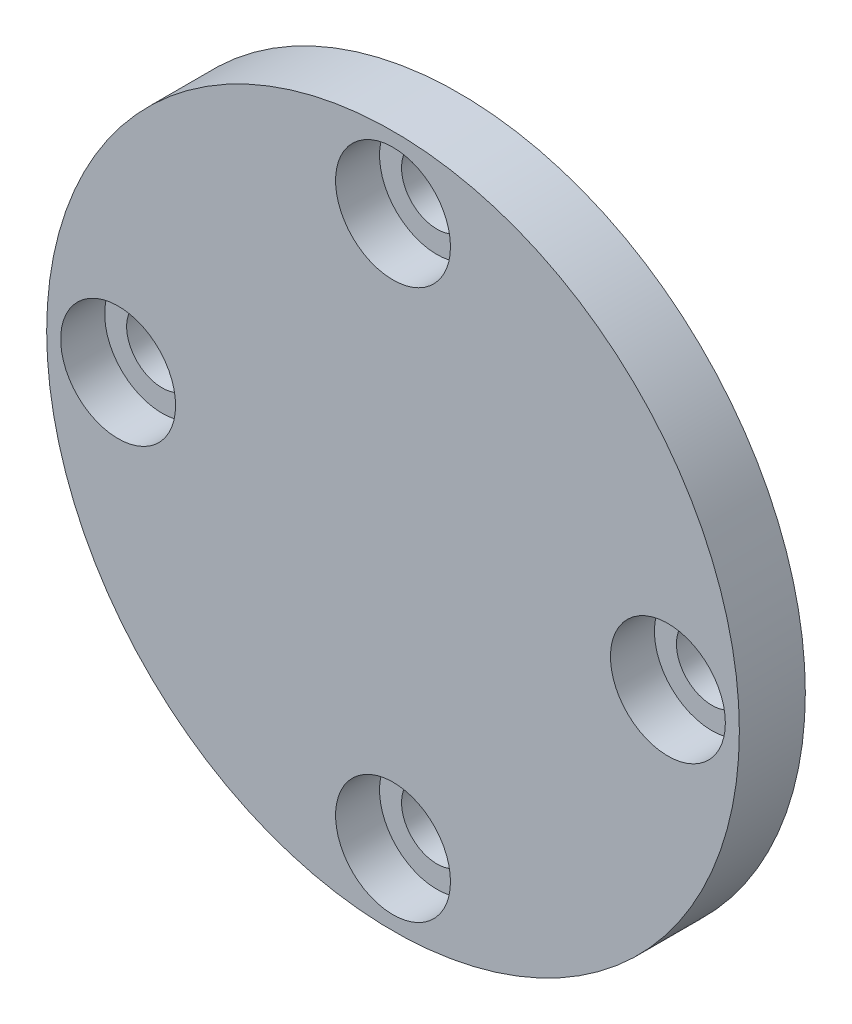
ISO-10303-21;
HEADER;
FILE_DESCRIPTION(('STEP AP214'),'2;1');
FILE_NAME('part.step','',(''),(''),'','','');
FILE_SCHEMA(('AUTOMOTIVE_DESIGN { 1 0 10303 214 1 1 1 1 }'));
ENDSEC;
DATA;
#1=APPLICATION_CONTEXT('core data for automotive mechanical design processes');
#2=APPLICATION_PROTOCOL_DEFINITION('international standard','automotive_design',2000,#1);
#3=PRODUCT_CONTEXT('',#1,'mechanical');
#4=PRODUCT('Part','Part','',(#3));
#5=PRODUCT_RELATED_PRODUCT_CATEGORY('part','',(#4));
#6=PRODUCT_DEFINITION_FORMATION('','',#4);
#7=PRODUCT_DEFINITION_CONTEXT('part definition',#1,'design');
#8=PRODUCT_DEFINITION('design','',#6,#7);
#9=PRODUCT_DEFINITION_SHAPE('','',#8);
#10=(LENGTH_UNIT() NAMED_UNIT(*) SI_UNIT(.MILLI.,.METRE.));
#11=(NAMED_UNIT(*) PLANE_ANGLE_UNIT() SI_UNIT($,.RADIAN.));
#12=(NAMED_UNIT(*) SI_UNIT($,.STERADIAN.) SOLID_ANGLE_UNIT());
#13=UNCERTAINTY_MEASURE_WITH_UNIT(LENGTH_MEASURE(1.E-05),#10,'distance_accuracy_value','');
#14=(GEOMETRIC_REPRESENTATION_CONTEXT(3) GLOBAL_UNCERTAINTY_ASSIGNED_CONTEXT((#13)) GLOBAL_UNIT_ASSIGNED_CONTEXT((#10,
#11,#12)) REPRESENTATION_CONTEXT('',''));
#15=CARTESIAN_POINT('',(0.,0.,0.));
#16=DIRECTION('',(0.,0.,1.));
#17=DIRECTION('',(1.,0.,0.));
#18=AXIS2_PLACEMENT_3D('',#15,#16,#17);
#19=CARTESIAN_POINT('',(25.,0.,6.));
#20=DIRECTION('',(0.,0.,-1.));
#21=DIRECTION('',(-1.,0.,0.));
#22=AXIS2_PLACEMENT_3D('',#19,#20,#21);
#23=CYLINDRICAL_SURFACE('',#22,3.225);
#24=CARTESIAN_POINT('',(25.,0.,0.));
#25=DIRECTION('',(0.,0.,1.));
#26=DIRECTION('',(1.,0.,0.));
#27=AXIS2_PLACEMENT_3D('',#24,#25,#26);
#28=CIRCLE('',#27,3.225);
#29=CARTESIAN_POINT('',(28.225,0.,0.));
#30=VERTEX_POINT('',#29);
#31=EDGE_CURVE('E51',#30,#30,#28,.T.);
#32=ORIENTED_EDGE('',*,*,#31,.F.);
#33=EDGE_LOOP('',(#32));
#34=FACE_BOUND('',#33,.T.);
#35=CARTESIAN_POINT('',(25.,0.,2.));
#36=DIRECTION('',(0.,0.,1.));
#37=DIRECTION('',(1.,0.,0.));
#38=AXIS2_PLACEMENT_3D('',#35,#36,#37);
#39=CIRCLE('',#38,3.225);
#40=CARTESIAN_POINT('',(28.225,0.,2.));
#41=VERTEX_POINT('',#40);
#42=EDGE_CURVE('E34',#41,#41,#39,.T.);
#43=ORIENTED_EDGE('',*,*,#42,.T.);
#44=EDGE_LOOP('',(#43));
#45=FACE_BOUND('',#44,.T.);
#46=ADVANCED_FACE('F30',(#34,#45),#23,.F.);
#47=CARTESIAN_POINT('',(0.,25.,6.));
#48=DIRECTION('',(0.,0.,-1.));
#49=DIRECTION('',(-1.,0.,0.));
#50=AXIS2_PLACEMENT_3D('',#47,#48,#49);
#51=CYLINDRICAL_SURFACE('',#50,3.225);
#52=CARTESIAN_POINT('',(0.,25.,0.));
#53=DIRECTION('',(0.,0.,1.));
#54=DIRECTION('',(1.,0.,0.));
#55=AXIS2_PLACEMENT_3D('',#52,#53,#54);
#56=CIRCLE('',#55,3.225);
#57=CARTESIAN_POINT('',(3.22499999999999,25.,0.));
#58=VERTEX_POINT('',#57);
#59=EDGE_CURVE('E84',#58,#58,#56,.T.);
#60=ORIENTED_EDGE('',*,*,#59,.F.);
#61=EDGE_LOOP('',(#60));
#62=FACE_BOUND('',#61,.T.);
#63=CARTESIAN_POINT('',(0.,25.,2.));
#64=DIRECTION('',(0.,0.,1.));
#65=DIRECTION('',(1.,0.,0.));
#66=AXIS2_PLACEMENT_3D('',#63,#64,#65);
#67=CIRCLE('',#66,3.225);
#68=CARTESIAN_POINT('',(3.22499999999999,25.,2.));
#69=VERTEX_POINT('',#68);
#70=EDGE_CURVE('E57',#69,#69,#67,.T.);
#71=ORIENTED_EDGE('',*,*,#70,.T.);
#72=EDGE_LOOP('',(#71));
#73=FACE_BOUND('',#72,.T.);
#74=ADVANCED_FACE('F127',(#62,#73),#51,.F.);
#75=CARTESIAN_POINT('',(-25.,0.,6.));
#76=DIRECTION('',(0.,0.,-1.));
#77=DIRECTION('',(-1.,0.,0.));
#78=AXIS2_PLACEMENT_3D('',#75,#76,#77);
#79=CYLINDRICAL_SURFACE('',#78,3.225);
#80=CARTESIAN_POINT('',(-25.,0.,0.));
#81=DIRECTION('',(0.,0.,1.));
#82=DIRECTION('',(1.,0.,0.));
#83=AXIS2_PLACEMENT_3D('',#80,#81,#82);
#84=CIRCLE('',#83,3.225);
#85=CARTESIAN_POINT('',(-21.775,0.,0.));
#86=VERTEX_POINT('',#85);
#87=EDGE_CURVE('E86',#86,#86,#84,.T.);
#88=ORIENTED_EDGE('',*,*,#87,.F.);
#89=EDGE_LOOP('',(#88));
#90=FACE_BOUND('',#89,.T.);
#91=CARTESIAN_POINT('',(-25.,0.,2.));
#92=DIRECTION('',(0.,0.,1.));
#93=DIRECTION('',(1.,0.,0.));
#94=AXIS2_PLACEMENT_3D('',#91,#92,#93);
#95=CIRCLE('',#94,3.225);
#96=CARTESIAN_POINT('',(-21.775,0.,2.));
#97=VERTEX_POINT('',#96);
#98=EDGE_CURVE('E53',#97,#97,#95,.T.);
#99=ORIENTED_EDGE('',*,*,#98,.T.);
#100=EDGE_LOOP('',(#99));
#101=FACE_BOUND('',#100,.T.);
#102=ADVANCED_FACE('F100',(#90,#101),#79,.F.);
#103=CARTESIAN_POINT('',(0.,-25.,6.));
#104=DIRECTION('',(0.,0.,-1.));
#105=DIRECTION('',(-1.,0.,0.));
#106=AXIS2_PLACEMENT_3D('',#103,#104,#105);
#107=CYLINDRICAL_SURFACE('',#106,3.225);
#108=CARTESIAN_POINT('',(0.,-25.,0.));
#109=DIRECTION('',(0.,0.,1.));
#110=DIRECTION('',(1.,0.,0.));
#111=AXIS2_PLACEMENT_3D('',#108,#109,#110);
#112=CIRCLE('',#111,3.225);
#113=CARTESIAN_POINT('',(3.22500000000001,-25.,0.));
#114=VERTEX_POINT('',#113);
#115=EDGE_CURVE('E43',#114,#114,#112,.T.);
#116=ORIENTED_EDGE('',*,*,#115,.F.);
#117=EDGE_LOOP('',(#116));
#118=FACE_BOUND('',#117,.T.);
#119=CARTESIAN_POINT('',(0.,-25.,2.));
#120=DIRECTION('',(0.,0.,1.));
#121=DIRECTION('',(1.,0.,0.));
#122=AXIS2_PLACEMENT_3D('',#119,#120,#121);
#123=CIRCLE('',#122,3.225);
#124=CARTESIAN_POINT('',(3.22500000000001,-25.,2.));
#125=VERTEX_POINT('',#124);
#126=EDGE_CURVE('E48',#125,#125,#123,.T.);
#127=ORIENTED_EDGE('',*,*,#126,.T.);
#128=EDGE_LOOP('',(#127));
#129=FACE_BOUND('',#128,.T.);
#130=ADVANCED_FACE('F96',(#118,#129),#107,.F.);
#131=CARTESIAN_POINT('',(0.,0.,6.));
#132=DIRECTION('',(0.,0.,1.));
#133=DIRECTION('',(1.,0.,0.));
#134=AXIS2_PLACEMENT_3D('',#131,#132,#133);
#135=PLANE('',#134);
#136=CARTESIAN_POINT('',(25.,0.,6.));
#137=DIRECTION('',(0.,0.,1.));
#138=DIRECTION('',(1.,0.,0.));
#139=AXIS2_PLACEMENT_3D('',#136,#137,#138);
#140=CIRCLE('',#139,5.225);
#141=CARTESIAN_POINT('',(30.225,0.,6.));
#142=VERTEX_POINT('',#141);
#143=EDGE_CURVE('E73',#142,#142,#140,.T.);
#144=ORIENTED_EDGE('',*,*,#143,.F.);
#145=EDGE_LOOP('',(#144));
#146=FACE_BOUND('',#145,.T.);
#147=CARTESIAN_POINT('',(0.,25.,6.));
#148=DIRECTION('',(0.,0.,1.));
#149=DIRECTION('',(1.,0.,0.));
#150=AXIS2_PLACEMENT_3D('',#147,#148,#149);
#151=CIRCLE('',#150,5.225);
#152=CARTESIAN_POINT('',(5.22499999999999,25.,6.));
#153=VERTEX_POINT('',#152);
#154=EDGE_CURVE('E66',#153,#153,#151,.T.);
#155=ORIENTED_EDGE('',*,*,#154,.F.);
#156=EDGE_LOOP('',(#155));
#157=FACE_BOUND('',#156,.T.);
#158=CARTESIAN_POINT('',(-25.,0.,6.));
#159=DIRECTION('',(0.,0.,1.));
#160=DIRECTION('',(1.,0.,0.));
#161=AXIS2_PLACEMENT_3D('',#158,#159,#160);
#162=CIRCLE('',#161,5.225);
#163=CARTESIAN_POINT('',(-19.775,0.,6.));
#164=VERTEX_POINT('',#163);
#165=EDGE_CURVE('E59',#164,#164,#162,.T.);
#166=ORIENTED_EDGE('',*,*,#165,.F.);
#167=EDGE_LOOP('',(#166));
#168=FACE_BOUND('',#167,.T.);
#169=CARTESIAN_POINT('',(0.,-25.,6.));
#170=DIRECTION('',(0.,0.,1.));
#171=DIRECTION('',(1.,0.,0.));
#172=AXIS2_PLACEMENT_3D('',#169,#170,#171);
#173=CIRCLE('',#172,5.225);
#174=CARTESIAN_POINT('',(5.22500000000001,-25.,6.));
#175=VERTEX_POINT('',#174);
#176=EDGE_CURVE('E55',#175,#175,#173,.T.);
#177=ORIENTED_EDGE('',*,*,#176,.F.);
#178=EDGE_LOOP('',(#177));
#179=FACE_BOUND('',#178,.T.);
#180=CARTESIAN_POINT('',(0.,0.,6.));
#181=DIRECTION('',(0.,0.,1.));
#182=DIRECTION('',(1.,0.,0.));
#183=AXIS2_PLACEMENT_3D('',#180,#181,#182);
#184=CIRCLE('',#183,31.5);
#185=CARTESIAN_POINT('',(31.5,0.,6.));
#186=VERTEX_POINT('',#185);
#187=EDGE_CURVE('E10',#186,#186,#184,.T.);
#188=ORIENTED_EDGE('',*,*,#187,.T.);
#189=EDGE_LOOP('',(#188));
#190=FACE_BOUND('',#189,.T.);
#191=ADVANCED_FACE('F99',(#146,#157,#168,#179,#190),#135,.T.);
#192=CARTESIAN_POINT('',(0.,0.,0.));
#193=DIRECTION('',(0.,0.,1.));
#194=DIRECTION('',(1.,0.,0.));
#195=AXIS2_PLACEMENT_3D('',#192,#193,#194);
#196=PLANE('',#195);
#197=ORIENTED_EDGE('',*,*,#59,.T.);
#198=EDGE_LOOP('',(#197));
#199=FACE_BOUND('',#198,.T.);
#200=ORIENTED_EDGE('',*,*,#115,.T.);
#201=EDGE_LOOP('',(#200));
#202=FACE_BOUND('',#201,.T.);
#203=CARTESIAN_POINT('',(0.,0.,0.));
#204=DIRECTION('',(0.,0.,1.));
#205=DIRECTION('',(1.,0.,0.));
#206=AXIS2_PLACEMENT_3D('',#203,#204,#205);
#207=CIRCLE('',#206,31.5);
#208=CARTESIAN_POINT('',(31.5,0.,0.));
#209=VERTEX_POINT('',#208);
#210=EDGE_CURVE('E38',#209,#209,#207,.T.);
#211=ORIENTED_EDGE('',*,*,#210,.F.);
#212=EDGE_LOOP('',(#211));
#213=FACE_BOUND('',#212,.T.);
#214=ORIENTED_EDGE('',*,*,#87,.T.);
#215=EDGE_LOOP('',(#214));
#216=FACE_BOUND('',#215,.T.);
#217=ORIENTED_EDGE('',*,*,#31,.T.);
#218=EDGE_LOOP('',(#217));
#219=FACE_BOUND('',#218,.T.);
#220=ADVANCED_FACE('F93',(#199,#202,#213,#216,#219),#196,.F.);
#221=CARTESIAN_POINT('',(0.,0.,6.));
#222=DIRECTION('',(0.,0.,-1.));
#223=DIRECTION('',(-1.,0.,0.));
#224=AXIS2_PLACEMENT_3D('',#221,#222,#223);
#225=CYLINDRICAL_SURFACE('',#224,31.5);
#226=ORIENTED_EDGE('',*,*,#187,.F.);
#227=EDGE_LOOP('',(#226));
#228=FACE_BOUND('',#227,.T.);
#229=ORIENTED_EDGE('',*,*,#210,.T.);
#230=EDGE_LOOP('',(#229));
#231=FACE_BOUND('',#230,.T.);
#232=ADVANCED_FACE('F32',(#228,#231),#225,.T.);
#233=CARTESIAN_POINT('',(0.,-25.,2.));
#234=DIRECTION('',(0.,0.,1.));
#235=DIRECTION('',(1.,0.,0.));
#236=AXIS2_PLACEMENT_3D('',#233,#234,#235);
#237=CYLINDRICAL_SURFACE('',#236,5.225);
#238=CARTESIAN_POINT('',(0.,-25.,2.));
#239=DIRECTION('',(0.,0.,1.));
#240=DIRECTION('',(1.,0.,0.));
#241=AXIS2_PLACEMENT_3D('',#238,#239,#240);
#242=CIRCLE('',#241,5.225);
#243=CARTESIAN_POINT('',(5.22500000000001,-25.,2.));
#244=VERTEX_POINT('',#243);
#245=EDGE_CURVE('E52',#244,#244,#242,.T.);
#246=ORIENTED_EDGE('',*,*,#245,.F.);
#247=EDGE_LOOP('',(#246));
#248=FACE_BOUND('',#247,.T.);
#249=ORIENTED_EDGE('',*,*,#176,.T.);
#250=EDGE_LOOP('',(#249));
#251=FACE_BOUND('',#250,.T.);
#252=ADVANCED_FACE('F108',(#248,#251),#237,.F.);
#253=CARTESIAN_POINT('',(0.,-25.,2.));
#254=DIRECTION('',(0.,0.,1.));
#255=DIRECTION('',(1.,0.,0.));
#256=AXIS2_PLACEMENT_3D('',#253,#254,#255);
#257=PLANE('',#256);
#258=ORIENTED_EDGE('',*,*,#126,.F.);
#259=EDGE_LOOP('',(#258));
#260=FACE_BOUND('',#259,.T.);
#261=ORIENTED_EDGE('',*,*,#245,.T.);
#262=EDGE_LOOP('',(#261));
#263=FACE_BOUND('',#262,.T.);
#264=ADVANCED_FACE('F104',(#260,#263),#257,.T.);
#265=CARTESIAN_POINT('',(-25.,0.,2.));
#266=DIRECTION('',(0.,0.,1.));
#267=DIRECTION('',(1.,0.,0.));
#268=AXIS2_PLACEMENT_3D('',#265,#266,#267);
#269=CYLINDRICAL_SURFACE('',#268,5.225);
#270=CARTESIAN_POINT('',(-25.,0.,2.));
#271=DIRECTION('',(0.,0.,1.));
#272=DIRECTION('',(1.,0.,0.));
#273=AXIS2_PLACEMENT_3D('',#270,#271,#272);
#274=CIRCLE('',#273,5.225);
#275=CARTESIAN_POINT('',(-19.775,0.,2.));
#276=VERTEX_POINT('',#275);
#277=EDGE_CURVE('E56',#276,#276,#274,.T.);
#278=ORIENTED_EDGE('',*,*,#277,.F.);
#279=EDGE_LOOP('',(#278));
#280=FACE_BOUND('',#279,.T.);
#281=ORIENTED_EDGE('',*,*,#165,.T.);
#282=EDGE_LOOP('',(#281));
#283=FACE_BOUND('',#282,.T.);
#284=ADVANCED_FACE('F107',(#280,#283),#269,.F.);
#285=CARTESIAN_POINT('',(-25.,0.,2.));
#286=DIRECTION('',(0.,0.,1.));
#287=DIRECTION('',(1.,0.,0.));
#288=AXIS2_PLACEMENT_3D('',#285,#286,#287);
#289=PLANE('',#288);
#290=ORIENTED_EDGE('',*,*,#98,.F.);
#291=EDGE_LOOP('',(#290));
#292=FACE_BOUND('',#291,.T.);
#293=ORIENTED_EDGE('',*,*,#277,.T.);
#294=EDGE_LOOP('',(#293));
#295=FACE_BOUND('',#294,.T.);
#296=ADVANCED_FACE('F145',(#292,#295),#289,.T.);
#297=CARTESIAN_POINT('',(0.,25.,2.));
#298=DIRECTION('',(0.,0.,1.));
#299=DIRECTION('',(1.,0.,0.));
#300=AXIS2_PLACEMENT_3D('',#297,#298,#299);
#301=CYLINDRICAL_SURFACE('',#300,5.225);
#302=CARTESIAN_POINT('',(0.,25.,2.));
#303=DIRECTION('',(0.,0.,1.));
#304=DIRECTION('',(1.,0.,0.));
#305=AXIS2_PLACEMENT_3D('',#302,#303,#304);
#306=CIRCLE('',#305,5.225);
#307=CARTESIAN_POINT('',(5.22499999999999,25.,2.));
#308=VERTEX_POINT('',#307);
#309=EDGE_CURVE('E60',#308,#308,#306,.T.);
#310=ORIENTED_EDGE('',*,*,#309,.F.);
#311=EDGE_LOOP('',(#310));
#312=FACE_BOUND('',#311,.T.);
#313=ORIENTED_EDGE('',*,*,#154,.T.);
#314=EDGE_LOOP('',(#313));
#315=FACE_BOUND('',#314,.T.);
#316=ADVANCED_FACE('F148',(#312,#315),#301,.F.);
#317=CARTESIAN_POINT('',(0.,25.,2.));
#318=DIRECTION('',(0.,0.,1.));
#319=DIRECTION('',(1.,0.,0.));
#320=AXIS2_PLACEMENT_3D('',#317,#318,#319);
#321=PLANE('',#320);
#322=ORIENTED_EDGE('',*,*,#70,.F.);
#323=EDGE_LOOP('',(#322));
#324=FACE_BOUND('',#323,.T.);
#325=ORIENTED_EDGE('',*,*,#309,.T.);
#326=EDGE_LOOP('',(#325));
#327=FACE_BOUND('',#326,.T.);
#328=ADVANCED_FACE('F162',(#324,#327),#321,.T.);
#329=CARTESIAN_POINT('',(25.,0.,2.));
#330=DIRECTION('',(0.,0.,1.));
#331=DIRECTION('',(1.,0.,0.));
#332=AXIS2_PLACEMENT_3D('',#329,#330,#331);
#333=CYLINDRICAL_SURFACE('',#332,5.225);
#334=CARTESIAN_POINT('',(25.,0.,2.));
#335=DIRECTION('',(0.,0.,1.));
#336=DIRECTION('',(1.,0.,0.));
#337=AXIS2_PLACEMENT_3D('',#334,#335,#336);
#338=CIRCLE('',#337,5.225);
#339=CARTESIAN_POINT('',(30.225,0.,2.));
#340=VERTEX_POINT('',#339);
#341=EDGE_CURVE('E181',#340,#340,#338,.T.);
#342=ORIENTED_EDGE('',*,*,#341,.F.);
#343=EDGE_LOOP('',(#342));
#344=FACE_BOUND('',#343,.T.);
#345=ORIENTED_EDGE('',*,*,#143,.T.);
#346=EDGE_LOOP('',(#345));
#347=FACE_BOUND('',#346,.T.);
#348=ADVANCED_FACE('F166',(#344,#347),#333,.F.);
#349=CARTESIAN_POINT('',(25.,0.,2.));
#350=DIRECTION('',(0.,0.,1.));
#351=DIRECTION('',(1.,0.,0.));
#352=AXIS2_PLACEMENT_3D('',#349,#350,#351);
#353=PLANE('',#352);
#354=ORIENTED_EDGE('',*,*,#42,.F.);
#355=EDGE_LOOP('',(#354));
#356=FACE_BOUND('',#355,.T.);
#357=ORIENTED_EDGE('',*,*,#341,.T.);
#358=EDGE_LOOP('',(#357));
#359=FACE_BOUND('',#358,.T.);
#360=ADVANCED_FACE('F170',(#356,#359),#353,.T.);
#361=CLOSED_SHELL('',(#46,#74,#102,#130,#191,#220,#232,#252,#264,#284,#296,#316,#328,#348,#360));
#362=MANIFOLD_SOLID_BREP('B2',#361);
#363=ADVANCED_BREP_SHAPE_REPRESENTATION('',(#18,#362),#14);
#364=SHAPE_DEFINITION_REPRESENTATION(#9,#363);
ENDSEC;
END-ISO-10303-21;
